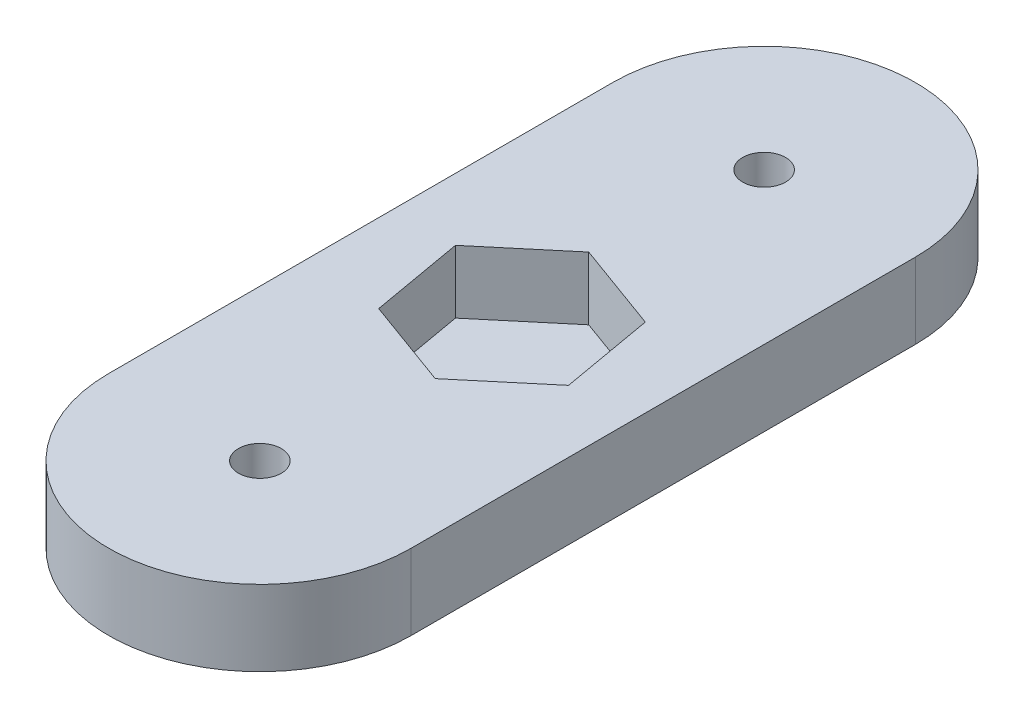
ISO-10303-21;
HEADER;
FILE_DESCRIPTION(('STEP AP214'),'2;1');
FILE_NAME('part.step','',(''),(''),'','','');
FILE_SCHEMA(('AUTOMOTIVE_DESIGN { 1 0 10303 214 1 1 1 1 }'));
ENDSEC;
DATA;
#1=APPLICATION_CONTEXT('core data for automotive mechanical design processes');
#2=APPLICATION_PROTOCOL_DEFINITION('international standard','automotive_design',2000,#1);
#3=PRODUCT_CONTEXT('',#1,'mechanical');
#4=PRODUCT('Part','Part','',(#3));
#5=PRODUCT_RELATED_PRODUCT_CATEGORY('part','',(#4));
#6=PRODUCT_DEFINITION_FORMATION('','',#4);
#7=PRODUCT_DEFINITION_CONTEXT('part definition',#1,'design');
#8=PRODUCT_DEFINITION('design','',#6,#7);
#9=PRODUCT_DEFINITION_SHAPE('','',#8);
#10=(LENGTH_UNIT() NAMED_UNIT(*) SI_UNIT(.MILLI.,.METRE.));
#11=(NAMED_UNIT(*) PLANE_ANGLE_UNIT() SI_UNIT($,.RADIAN.));
#12=(NAMED_UNIT(*) SI_UNIT($,.STERADIAN.) SOLID_ANGLE_UNIT());
#13=UNCERTAINTY_MEASURE_WITH_UNIT(LENGTH_MEASURE(1.E-05),#10,'distance_accuracy_value','');
#14=(GEOMETRIC_REPRESENTATION_CONTEXT(3) GLOBAL_UNCERTAINTY_ASSIGNED_CONTEXT((#13)) GLOBAL_UNIT_ASSIGNED_CONTEXT((#10,
#11,#12)) REPRESENTATION_CONTEXT('',''));
#15=CARTESIAN_POINT('',(0.,0.,0.));
#16=DIRECTION('',(0.,0.,1.));
#17=DIRECTION('',(1.,0.,0.));
#18=AXIS2_PLACEMENT_3D('',#15,#16,#17);
#19=CARTESIAN_POINT('',(0.,6.,0.));
#20=DIRECTION('',(0.,1.,0.));
#21=DIRECTION('',(0.,0.,1.));
#22=AXIS2_PLACEMENT_3D('',#19,#20,#21);
#23=PLANE('',#22);
#24=DIRECTION('',(0.939692620785909,0.,0.342020143325666));
#25=VECTOR('',#24,1.);
#26=CARTESIAN_POINT('',(-5.74958755079745,6.,-15.1755232067043));
#27=LINE('',#26,#25);
#28=CARTESIAN_POINT('',(-5.74958755079745,6.,-15.1755232067043));
#29=VERTEX_POINT('',#28);
#30=CARTESIAN_POINT('',(1.30332568756379,6.,-12.6084727230788));
#31=VERTEX_POINT('',#30);
#32=EDGE_CURVE('E48',#29,#31,#27,.T.);
#33=ORIENTED_EDGE('',*,*,#32,.F.);
#34=DIRECTION('',(0.173648177666933,0.,0.984807753012208));
#35=VECTOR('',#34,1.);
#36=CARTESIAN_POINT('',(-7.05291323836124,6.,-22.5670504836255));
#37=LINE('',#36,#35);
#38=CARTESIAN_POINT('',(-7.05291323836124,6.,-22.5670504836255));
#39=VERTEX_POINT('',#38);
#40=EDGE_CURVE('E140',#39,#29,#37,.T.);
#41=ORIENTED_EDGE('',*,*,#40,.F.);
#42=DIRECTION('',(-0.766044443118976,0.,0.642787609686541));
#43=VECTOR('',#42,1.);
#44=CARTESIAN_POINT('',(-1.30332568756379,6.,-27.3915272769212));
#45=LINE('',#44,#43);
#46=CARTESIAN_POINT('',(-1.30332568756379,6.,-27.3915272769212));
#47=VERTEX_POINT('',#46);
#48=EDGE_CURVE('E143',#47,#39,#45,.T.);
#49=ORIENTED_EDGE('',*,*,#48,.F.);
#50=DIRECTION('',(-0.939692620785909,0.,-0.342020143325666));
#51=VECTOR('',#50,1.);
#52=CARTESIAN_POINT('',(5.74958755079745,6.,-24.8244767932956));
#53=LINE('',#52,#51);
#54=CARTESIAN_POINT('',(5.74958755079745,6.,-24.8244767932956));
#55=VERTEX_POINT('',#54);
#56=EDGE_CURVE('E159',#55,#47,#53,.T.);
#57=ORIENTED_EDGE('',*,*,#56,.F.);
#58=DIRECTION('',(-0.173648177666933,0.,-0.984807753012208));
#59=VECTOR('',#58,1.);
#60=CARTESIAN_POINT('',(7.05291323836125,6.,-17.4329495163745));
#61=LINE('',#60,#59);
#62=CARTESIAN_POINT('',(7.05291323836125,6.,-17.4329495163745));
#63=VERTEX_POINT('',#62);
#64=EDGE_CURVE('E156',#63,#55,#61,.T.);
#65=ORIENTED_EDGE('',*,*,#64,.F.);
#66=DIRECTION('',(0.766044443118977,0.,-0.642787609686541));
#67=VECTOR('',#66,1.);
#68=CARTESIAN_POINT('',(1.30332568756379,6.,-12.6084727230788));
#69=LINE('',#68,#67);
#70=EDGE_CURVE('E154',#31,#63,#69,.T.);
#71=ORIENTED_EDGE('',*,*,#70,.F.);
#72=EDGE_LOOP('',(#33,#41,#49,#57,#65,#71));
#73=FACE_BOUND('',#72,.T.);
#74=CARTESIAN_POINT('',(0.,6.,-40.));
#75=DIRECTION('',(0.,1.,0.));
#76=DIRECTION('',(0.,0.,1.));
#77=AXIS2_PLACEMENT_3D('',#74,#75,#76);
#78=CIRCLE('',#77,1.7);
#79=CARTESIAN_POINT('',(0.,6.,-38.3));
#80=VERTEX_POINT('',#79);
#81=EDGE_CURVE('E180',#80,#80,#78,.T.);
#82=ORIENTED_EDGE('',*,*,#81,.F.);
#83=EDGE_LOOP('',(#82));
#84=FACE_BOUND('',#83,.T.);
#85=CARTESIAN_POINT('',(0.,6.,0.));
#86=DIRECTION('',(0.,1.,0.));
#87=DIRECTION('',(0.,0.,1.));
#88=AXIS2_PLACEMENT_3D('',#85,#86,#87);
#89=CIRCLE('',#88,12.);
#90=CARTESIAN_POINT('',(-12.,6.,0.));
#91=VERTEX_POINT('',#90);
#92=CARTESIAN_POINT('',(12.,6.,0.));
#93=VERTEX_POINT('',#92);
#94=EDGE_CURVE('E186',#91,#93,#89,.T.);
#95=ORIENTED_EDGE('',*,*,#94,.T.);
#96=DIRECTION('',(0.,0.,-1.));
#97=VECTOR('',#96,1.);
#98=CARTESIAN_POINT('',(12.,6.,0.));
#99=LINE('',#98,#97);
#100=CARTESIAN_POINT('',(12.,6.,-40.));
#101=VERTEX_POINT('',#100);
#102=EDGE_CURVE('E85',#93,#101,#99,.T.);
#103=ORIENTED_EDGE('',*,*,#102,.T.);
#104=CARTESIAN_POINT('',(0.,6.,-40.));
#105=DIRECTION('',(0.,1.,0.));
#106=DIRECTION('',(0.,0.,1.));
#107=AXIS2_PLACEMENT_3D('',#104,#105,#106);
#108=CIRCLE('',#107,12.);
#109=CARTESIAN_POINT('',(-12.,6.,-40.));
#110=VERTEX_POINT('',#109);
#111=EDGE_CURVE('E189',#101,#110,#108,.T.);
#112=ORIENTED_EDGE('',*,*,#111,.T.);
#113=DIRECTION('',(0.,0.,1.));
#114=VECTOR('',#113,1.);
#115=CARTESIAN_POINT('',(-12.,6.,0.));
#116=LINE('',#115,#114);
#117=EDGE_CURVE('E57',#110,#91,#116,.T.);
#118=ORIENTED_EDGE('',*,*,#117,.T.);
#119=EDGE_LOOP('',(#95,#103,#112,#118));
#120=FACE_BOUND('',#119,.T.);
#121=CARTESIAN_POINT('',(0.,6.,0.));
#122=DIRECTION('',(0.,1.,0.));
#123=DIRECTION('',(0.,0.,1.));
#124=AXIS2_PLACEMENT_3D('',#121,#122,#123);
#125=CIRCLE('',#124,1.7);
#126=CARTESIAN_POINT('',(0.,6.,1.7));
#127=VERTEX_POINT('',#126);
#128=EDGE_CURVE('E174',#127,#127,#125,.T.);
#129=ORIENTED_EDGE('',*,*,#128,.F.);
#130=EDGE_LOOP('',(#129));
#131=FACE_BOUND('',#130,.T.);
#132=ADVANCED_FACE('F33',(#73,#84,#120,#131),#23,.T.);
#133=CARTESIAN_POINT('',(0.,0.,0.));
#134=DIRECTION('',(0.,1.,0.));
#135=DIRECTION('',(0.,0.,1.));
#136=AXIS2_PLACEMENT_3D('',#133,#134,#135);
#137=PLANE('',#136);
#138=CARTESIAN_POINT('',(0.,0.,-40.));
#139=DIRECTION('',(0.,1.,0.));
#140=DIRECTION('',(0.,0.,1.));
#141=AXIS2_PLACEMENT_3D('',#138,#139,#140);
#142=CIRCLE('',#141,1.7);
#143=CARTESIAN_POINT('',(0.,0.,-38.3));
#144=VERTEX_POINT('',#143);
#145=EDGE_CURVE('E177',#144,#144,#142,.T.);
#146=ORIENTED_EDGE('',*,*,#145,.T.);
#147=EDGE_LOOP('',(#146));
#148=FACE_BOUND('',#147,.T.);
#149=CARTESIAN_POINT('',(0.,0.,0.));
#150=DIRECTION('',(0.,1.,0.));
#151=DIRECTION('',(0.,0.,1.));
#152=AXIS2_PLACEMENT_3D('',#149,#150,#151);
#153=CIRCLE('',#152,12.);
#154=CARTESIAN_POINT('',(-12.,0.,0.));
#155=VERTEX_POINT('',#154);
#156=CARTESIAN_POINT('',(12.,0.,0.));
#157=VERTEX_POINT('',#156);
#158=EDGE_CURVE('E183',#155,#157,#153,.T.);
#159=ORIENTED_EDGE('',*,*,#158,.F.);
#160=DIRECTION('',(0.,0.,1.));
#161=VECTOR('',#160,1.);
#162=CARTESIAN_POINT('',(-12.,0.,0.));
#163=LINE('',#162,#161);
#164=CARTESIAN_POINT('',(-12.,0.,-40.));
#165=VERTEX_POINT('',#164);
#166=EDGE_CURVE('E78',#165,#155,#163,.T.);
#167=ORIENTED_EDGE('',*,*,#166,.F.);
#168=CARTESIAN_POINT('',(0.,0.,-40.));
#169=DIRECTION('',(0.,1.,0.));
#170=DIRECTION('',(0.,0.,1.));
#171=AXIS2_PLACEMENT_3D('',#168,#169,#170);
#172=CIRCLE('',#171,12.);
#173=CARTESIAN_POINT('',(12.,0.,-40.));
#174=VERTEX_POINT('',#173);
#175=EDGE_CURVE('E197',#174,#165,#172,.T.);
#176=ORIENTED_EDGE('',*,*,#175,.F.);
#177=DIRECTION('',(0.,0.,-1.));
#178=VECTOR('',#177,1.);
#179=CARTESIAN_POINT('',(12.,0.,0.));
#180=LINE('',#179,#178);
#181=EDGE_CURVE('E195',#157,#174,#180,.T.);
#182=ORIENTED_EDGE('',*,*,#181,.F.);
#183=EDGE_LOOP('',(#159,#167,#176,#182));
#184=FACE_BOUND('',#183,.T.);
#185=CARTESIAN_POINT('',(0.,0.,0.));
#186=DIRECTION('',(0.,1.,0.));
#187=DIRECTION('',(0.,0.,1.));
#188=AXIS2_PLACEMENT_3D('',#185,#186,#187);
#189=CIRCLE('',#188,1.7);
#190=CARTESIAN_POINT('',(0.,0.,1.7));
#191=VERTEX_POINT('',#190);
#192=EDGE_CURVE('E166',#191,#191,#189,.T.);
#193=ORIENTED_EDGE('',*,*,#192,.T.);
#194=EDGE_LOOP('',(#193));
#195=FACE_BOUND('',#194,.T.);
#196=ADVANCED_FACE('F210',(#148,#184,#195),#137,.F.);
#197=CARTESIAN_POINT('',(0.,6.,0.));
#198=DIRECTION('',(0.,-1.,0.));
#199=DIRECTION('',(0.,0.,-1.));
#200=AXIS2_PLACEMENT_3D('',#197,#198,#199);
#201=CYLINDRICAL_SURFACE('',#200,12.);
#202=ORIENTED_EDGE('',*,*,#158,.T.);
#203=DIRECTION('',(0.,-1.,0.));
#204=VECTOR('',#203,1.);
#205=CARTESIAN_POINT('',(12.,6.,0.));
#206=LINE('',#205,#204);
#207=EDGE_CURVE('E11',#93,#157,#206,.T.);
#208=ORIENTED_EDGE('',*,*,#207,.F.);
#209=ORIENTED_EDGE('',*,*,#94,.F.);
#210=DIRECTION('',(0.,-1.,0.));
#211=VECTOR('',#210,1.);
#212=CARTESIAN_POINT('',(-12.,6.,0.));
#213=LINE('',#212,#211);
#214=EDGE_CURVE('E192',#91,#155,#213,.T.);
#215=ORIENTED_EDGE('',*,*,#214,.T.);
#216=EDGE_LOOP('',(#202,#208,#209,#215));
#217=FACE_BOUND('',#216,.T.);
#218=ADVANCED_FACE('F35',(#217),#201,.T.);
#219=CARTESIAN_POINT('',(12.,6.,0.));
#220=DIRECTION('',(-1.,0.,0.));
#221=DIRECTION('',(0.,0.,1.));
#222=AXIS2_PLACEMENT_3D('',#219,#220,#221);
#223=PLANE('',#222);
#224=ORIENTED_EDGE('',*,*,#181,.T.);
#225=DIRECTION('',(0.,-1.,0.));
#226=VECTOR('',#225,1.);
#227=CARTESIAN_POINT('',(12.,6.,-40.));
#228=LINE('',#227,#226);
#229=EDGE_CURVE('E41',#101,#174,#228,.T.);
#230=ORIENTED_EDGE('',*,*,#229,.F.);
#231=ORIENTED_EDGE('',*,*,#102,.F.);
#232=ORIENTED_EDGE('',*,*,#207,.T.);
#233=EDGE_LOOP('',(#224,#230,#231,#232));
#234=FACE_BOUND('',#233,.T.);
#235=ADVANCED_FACE('F226',(#234),#223,.F.);
#236=CARTESIAN_POINT('',(0.,6.,-40.));
#237=DIRECTION('',(0.,-1.,0.));
#238=DIRECTION('',(0.,0.,-1.));
#239=AXIS2_PLACEMENT_3D('',#236,#237,#238);
#240=CYLINDRICAL_SURFACE('',#239,12.);
#241=ORIENTED_EDGE('',*,*,#175,.T.);
#242=DIRECTION('',(0.,-1.,0.));
#243=VECTOR('',#242,1.);
#244=CARTESIAN_POINT('',(-12.,6.,-40.));
#245=LINE('',#244,#243);
#246=EDGE_CURVE('E201',#110,#165,#245,.T.);
#247=ORIENTED_EDGE('',*,*,#246,.F.);
#248=ORIENTED_EDGE('',*,*,#111,.F.);
#249=ORIENTED_EDGE('',*,*,#229,.T.);
#250=EDGE_LOOP('',(#241,#247,#248,#249));
#251=FACE_BOUND('',#250,.T.);
#252=ADVANCED_FACE('F206',(#251),#240,.T.);
#253=CARTESIAN_POINT('',(-12.,6.,0.));
#254=DIRECTION('',(1.,0.,0.));
#255=DIRECTION('',(0.,0.,-1.));
#256=AXIS2_PLACEMENT_3D('',#253,#254,#255);
#257=PLANE('',#256);
#258=ORIENTED_EDGE('',*,*,#166,.T.);
#259=ORIENTED_EDGE('',*,*,#214,.F.);
#260=ORIENTED_EDGE('',*,*,#117,.F.);
#261=ORIENTED_EDGE('',*,*,#246,.T.);
#262=EDGE_LOOP('',(#258,#259,#260,#261));
#263=FACE_BOUND('',#262,.T.);
#264=ADVANCED_FACE('F215',(#263),#257,.F.);
#265=CARTESIAN_POINT('',(0.,6.,-40.));
#266=DIRECTION('',(0.,-1.,0.));
#267=DIRECTION('',(0.,0.,-1.));
#268=AXIS2_PLACEMENT_3D('',#265,#266,#267);
#269=CYLINDRICAL_SURFACE('',#268,1.7);
#270=ORIENTED_EDGE('',*,*,#81,.T.);
#271=EDGE_LOOP('',(#270));
#272=FACE_BOUND('',#271,.T.);
#273=ORIENTED_EDGE('',*,*,#145,.F.);
#274=EDGE_LOOP('',(#273));
#275=FACE_BOUND('',#274,.T.);
#276=ADVANCED_FACE('F217',(#272,#275),#269,.F.);
#277=CARTESIAN_POINT('',(0.,6.,0.));
#278=DIRECTION('',(0.,-1.,0.));
#279=DIRECTION('',(0.,0.,-1.));
#280=AXIS2_PLACEMENT_3D('',#277,#278,#279);
#281=CYLINDRICAL_SURFACE('',#280,1.7);
#282=ORIENTED_EDGE('',*,*,#128,.T.);
#283=EDGE_LOOP('',(#282));
#284=FACE_BOUND('',#283,.T.);
#285=ORIENTED_EDGE('',*,*,#192,.F.);
#286=EDGE_LOOP('',(#285));
#287=FACE_BOUND('',#286,.T.);
#288=ADVANCED_FACE('F223',(#284,#287),#281,.F.);
#289=CARTESIAN_POINT('',(-5.74958755079745,1.,-15.1755232067043));
#290=DIRECTION('',(-0.342020143325666,0.,0.939692620785909));
#291=DIRECTION('',(0.939692620785909,0.,0.342020143325666));
#292=AXIS2_PLACEMENT_3D('',#289,#290,#291);
#293=PLANE('',#292);
#294=ORIENTED_EDGE('',*,*,#32,.T.);
#295=DIRECTION('',(0.,1.,0.));
#296=VECTOR('',#295,1.);
#297=CARTESIAN_POINT('',(1.30332568756379,1.,-12.6084727230788));
#298=LINE('',#297,#296);
#299=CARTESIAN_POINT('',(1.30332568756379,1.,-12.6084727230788));
#300=VERTEX_POINT('',#299);
#301=EDGE_CURVE('E117',#300,#31,#298,.T.);
#302=ORIENTED_EDGE('',*,*,#301,.F.);
#303=DIRECTION('',(0.939692620785909,0.,0.342020143325666));
#304=VECTOR('',#303,1.);
#305=CARTESIAN_POINT('',(-5.74958755079745,1.,-15.1755232067043));
#306=LINE('',#305,#304);
#307=CARTESIAN_POINT('',(-5.74958755079745,1.,-15.1755232067043));
#308=VERTEX_POINT('',#307);
#309=EDGE_CURVE('E121',#308,#300,#306,.T.);
#310=ORIENTED_EDGE('',*,*,#309,.F.);
#311=DIRECTION('',(0.,1.,0.));
#312=VECTOR('',#311,1.);
#313=CARTESIAN_POINT('',(-5.74958755079745,1.,-15.1755232067043));
#314=LINE('',#313,#312);
#315=EDGE_CURVE('E164',#308,#29,#314,.T.);
#316=ORIENTED_EDGE('',*,*,#315,.T.);
#317=EDGE_LOOP('',(#294,#302,#310,#316));
#318=FACE_BOUND('',#317,.T.);
#319=ADVANCED_FACE('F119',(#318),#293,.F.);
#320=CARTESIAN_POINT('',(-7.05291323836124,1.,-22.5670504836255));
#321=DIRECTION('',(-0.984807753012208,0.,0.173648177666933));
#322=DIRECTION('',(0.173648177666933,0.,0.984807753012208));
#323=AXIS2_PLACEMENT_3D('',#320,#321,#322);
#324=PLANE('',#323);
#325=ORIENTED_EDGE('',*,*,#40,.T.);
#326=ORIENTED_EDGE('',*,*,#315,.F.);
#327=DIRECTION('',(0.173648177666933,0.,0.984807753012208));
#328=VECTOR('',#327,1.);
#329=CARTESIAN_POINT('',(-7.05291323836124,1.,-22.5670504836255));
#330=LINE('',#329,#328);
#331=CARTESIAN_POINT('',(-7.05291323836124,1.,-22.5670504836255));
#332=VERTEX_POINT('',#331);
#333=EDGE_CURVE('E127',#332,#308,#330,.T.);
#334=ORIENTED_EDGE('',*,*,#333,.F.);
#335=DIRECTION('',(0.,1.,0.));
#336=VECTOR('',#335,1.);
#337=CARTESIAN_POINT('',(-7.05291323836124,1.,-22.5670504836255));
#338=LINE('',#337,#336);
#339=EDGE_CURVE('E167',#332,#39,#338,.T.);
#340=ORIENTED_EDGE('',*,*,#339,.T.);
#341=EDGE_LOOP('',(#325,#326,#334,#340));
#342=FACE_BOUND('',#341,.T.);
#343=ADVANCED_FACE('F243',(#342),#324,.F.);
#344=CARTESIAN_POINT('',(-1.30332568756379,1.,-27.3915272769212));
#345=DIRECTION('',(-0.642787609686541,0.,-0.766044443118976));
#346=DIRECTION('',(-0.766044443118976,0.,0.642787609686541));
#347=AXIS2_PLACEMENT_3D('',#344,#345,#346);
#348=PLANE('',#347);
#349=ORIENTED_EDGE('',*,*,#48,.T.);
#350=ORIENTED_EDGE('',*,*,#339,.F.);
#351=DIRECTION('',(-0.766044443118976,0.,0.642787609686541));
#352=VECTOR('',#351,1.);
#353=CARTESIAN_POINT('',(-1.30332568756379,1.,-27.3915272769212));
#354=LINE('',#353,#352);
#355=CARTESIAN_POINT('',(-1.30332568756379,1.,-27.3915272769212));
#356=VERTEX_POINT('',#355);
#357=EDGE_CURVE('E150',#356,#332,#354,.T.);
#358=ORIENTED_EDGE('',*,*,#357,.F.);
#359=DIRECTION('',(0.,1.,0.));
#360=VECTOR('',#359,1.);
#361=CARTESIAN_POINT('',(-1.30332568756379,1.,-27.3915272769212));
#362=LINE('',#361,#360);
#363=EDGE_CURVE('E169',#356,#47,#362,.T.);
#364=ORIENTED_EDGE('',*,*,#363,.T.);
#365=EDGE_LOOP('',(#349,#350,#358,#364));
#366=FACE_BOUND('',#365,.T.);
#367=ADVANCED_FACE('F253',(#366),#348,.F.);
#368=CARTESIAN_POINT('',(5.74958755079745,1.,-24.8244767932956));
#369=DIRECTION('',(0.342020143325666,0.,-0.939692620785909));
#370=DIRECTION('',(-0.939692620785909,0.,-0.342020143325666));
#371=AXIS2_PLACEMENT_3D('',#368,#369,#370);
#372=PLANE('',#371);
#373=ORIENTED_EDGE('',*,*,#56,.T.);
#374=ORIENTED_EDGE('',*,*,#363,.F.);
#375=DIRECTION('',(-0.939692620785909,0.,-0.342020143325666));
#376=VECTOR('',#375,1.);
#377=CARTESIAN_POINT('',(5.74958755079745,1.,-24.8244767932956));
#378=LINE('',#377,#376);
#379=CARTESIAN_POINT('',(5.74958755079745,1.,-24.8244767932956));
#380=VERTEX_POINT('',#379);
#381=EDGE_CURVE('E147',#380,#356,#378,.T.);
#382=ORIENTED_EDGE('',*,*,#381,.F.);
#383=DIRECTION('',(0.,1.,0.));
#384=VECTOR('',#383,1.);
#385=CARTESIAN_POINT('',(5.74958755079745,1.,-24.8244767932956));
#386=LINE('',#385,#384);
#387=EDGE_CURVE('E171',#380,#55,#386,.T.);
#388=ORIENTED_EDGE('',*,*,#387,.T.);
#389=EDGE_LOOP('',(#373,#374,#382,#388));
#390=FACE_BOUND('',#389,.T.);
#391=ADVANCED_FACE('F249',(#390),#372,.F.);
#392=CARTESIAN_POINT('',(7.05291323836125,1.,-17.4329495163745));
#393=DIRECTION('',(0.984807753012208,0.,-0.173648177666933));
#394=DIRECTION('',(-0.173648177666933,0.,-0.984807753012208));
#395=AXIS2_PLACEMENT_3D('',#392,#393,#394);
#396=PLANE('',#395);
#397=ORIENTED_EDGE('',*,*,#64,.T.);
#398=ORIENTED_EDGE('',*,*,#387,.F.);
#399=DIRECTION('',(-0.173648177666933,0.,-0.984807753012208));
#400=VECTOR('',#399,1.);
#401=CARTESIAN_POINT('',(7.05291323836125,1.,-17.4329495163745));
#402=LINE('',#401,#400);
#403=CARTESIAN_POINT('',(7.05291323836125,1.,-17.4329495163745));
#404=VERTEX_POINT('',#403);
#405=EDGE_CURVE('E135',#404,#380,#402,.T.);
#406=ORIENTED_EDGE('',*,*,#405,.F.);
#407=DIRECTION('',(0.,1.,0.));
#408=VECTOR('',#407,1.);
#409=CARTESIAN_POINT('',(7.05291323836125,1.,-17.4329495163745));
#410=LINE('',#409,#408);
#411=EDGE_CURVE('E126',#404,#63,#410,.T.);
#412=ORIENTED_EDGE('',*,*,#411,.T.);
#413=EDGE_LOOP('',(#397,#398,#406,#412));
#414=FACE_BOUND('',#413,.T.);
#415=ADVANCED_FACE('F246',(#414),#396,.F.);
#416=CARTESIAN_POINT('',(1.30332568756379,1.,-12.6084727230788));
#417=DIRECTION('',(0.642787609686541,0.,0.766044443118977));
#418=DIRECTION('',(0.766044443118977,0.,-0.642787609686541));
#419=AXIS2_PLACEMENT_3D('',#416,#417,#418);
#420=PLANE('',#419);
#421=ORIENTED_EDGE('',*,*,#70,.T.);
#422=ORIENTED_EDGE('',*,*,#411,.F.);
#423=DIRECTION('',(0.766044443118977,0.,-0.642787609686541));
#424=VECTOR('',#423,1.);
#425=CARTESIAN_POINT('',(1.30332568756379,1.,-12.6084727230788));
#426=LINE('',#425,#424);
#427=EDGE_CURVE('E130',#300,#404,#426,.T.);
#428=ORIENTED_EDGE('',*,*,#427,.F.);
#429=ORIENTED_EDGE('',*,*,#301,.T.);
#430=EDGE_LOOP('',(#421,#422,#428,#429));
#431=FACE_BOUND('',#430,.T.);
#432=ADVANCED_FACE('F131',(#431),#420,.F.);
#433=CARTESIAN_POINT('',(0.,1.,0.));
#434=DIRECTION('',(0.,1.,0.));
#435=DIRECTION('',(0.,0.,1.));
#436=AXIS2_PLACEMENT_3D('',#433,#434,#435);
#437=PLANE('',#436);
#438=ORIENTED_EDGE('',*,*,#309,.T.);
#439=ORIENTED_EDGE('',*,*,#427,.T.);
#440=ORIENTED_EDGE('',*,*,#405,.T.);
#441=ORIENTED_EDGE('',*,*,#381,.T.);
#442=ORIENTED_EDGE('',*,*,#357,.T.);
#443=ORIENTED_EDGE('',*,*,#333,.T.);
#444=EDGE_LOOP('',(#438,#439,#440,#441,#442,#443));
#445=FACE_BOUND('',#444,.T.);
#446=ADVANCED_FACE('F137',(#445),#437,.T.);
#447=CLOSED_SHELL('',(#132,#196,#218,#235,#252,#264,#276,#288,#319,#343,#367,#391,#415,#432,#446));
#448=MANIFOLD_SOLID_BREP('B2',#447);
#449=ADVANCED_BREP_SHAPE_REPRESENTATION('',(#18,#448),#14);
#450=SHAPE_DEFINITION_REPRESENTATION(#9,#449);
ENDSEC;
END-ISO-10303-21;
